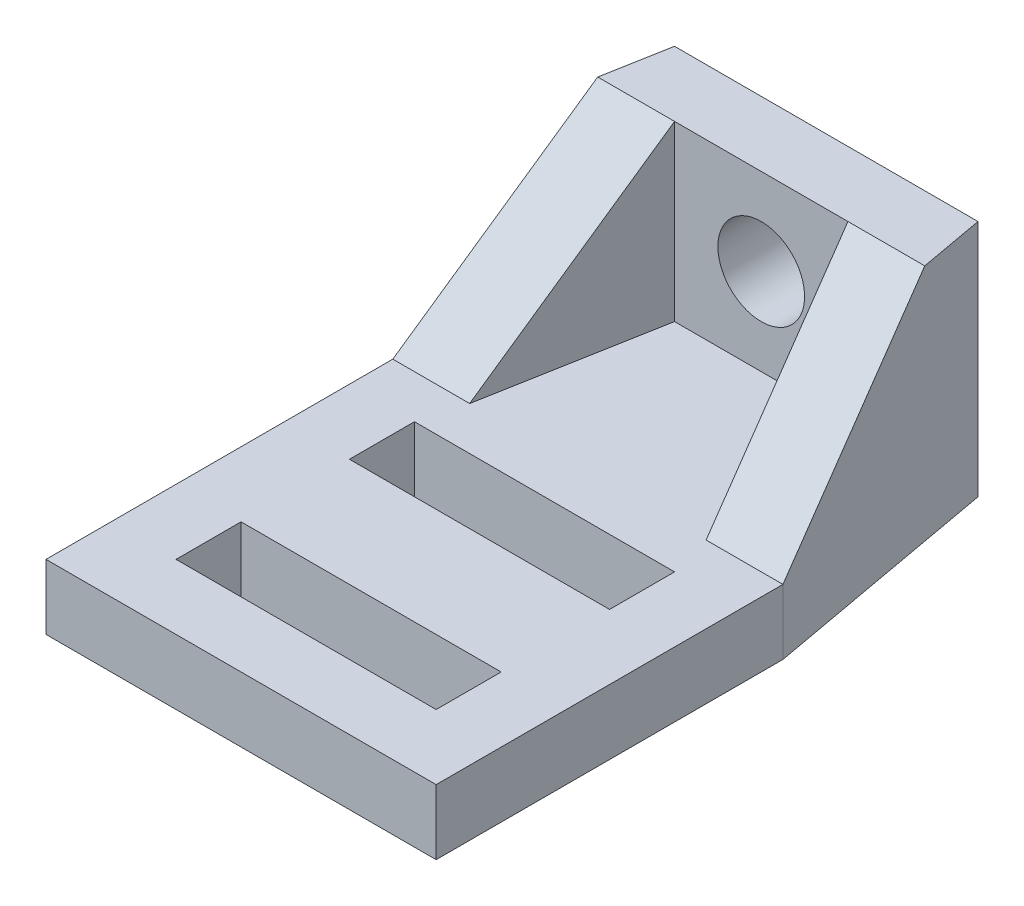
ISO-10303-21;
HEADER;
FILE_DESCRIPTION(('STEP AP214'),'2;1');
FILE_NAME('part.step','',(''),(''),'','','');
FILE_SCHEMA(('AUTOMOTIVE_DESIGN { 1 0 10303 214 1 1 1 1 }'));
ENDSEC;
DATA;
#1=APPLICATION_CONTEXT('core data for automotive mechanical design processes');
#2=APPLICATION_PROTOCOL_DEFINITION('international standard','automotive_design',2000,#1);
#3=PRODUCT_CONTEXT('',#1,'mechanical');
#4=PRODUCT('Part','Part','',(#3));
#5=PRODUCT_RELATED_PRODUCT_CATEGORY('part','',(#4));
#6=PRODUCT_DEFINITION_FORMATION('','',#4);
#7=PRODUCT_DEFINITION_CONTEXT('part definition',#1,'design');
#8=PRODUCT_DEFINITION('design','',#6,#7);
#9=PRODUCT_DEFINITION_SHAPE('','',#8);
#10=(LENGTH_UNIT() NAMED_UNIT(*) SI_UNIT(.MILLI.,.METRE.));
#11=(NAMED_UNIT(*) PLANE_ANGLE_UNIT() SI_UNIT($,.RADIAN.));
#12=(NAMED_UNIT(*) SI_UNIT($,.STERADIAN.) SOLID_ANGLE_UNIT());
#13=UNCERTAINTY_MEASURE_WITH_UNIT(LENGTH_MEASURE(1.E-05),#10,'distance_accuracy_value','');
#14=(GEOMETRIC_REPRESENTATION_CONTEXT(3) GLOBAL_UNCERTAINTY_ASSIGNED_CONTEXT((#13)) GLOBAL_UNIT_ASSIGNED_CONTEXT((#10,
#11,#12)) REPRESENTATION_CONTEXT('',''));
#15=CARTESIAN_POINT('',(0.,0.,0.));
#16=DIRECTION('',(0.,0.,1.));
#17=DIRECTION('',(1.,0.,0.));
#18=AXIS2_PLACEMENT_3D('',#15,#16,#17);
#19=CARTESIAN_POINT('',(7.,3.,-13.5));
#20=DIRECTION('',(-0.983869910099908,0.,0.178885438199983));
#21=DIRECTION('',(0.178885438199983,0.,0.983869910099908));
#22=AXIS2_PLACEMENT_3D('',#19,#20,#21);
#23=PLANE('',#22);
#24=DIRECTION('',(-0.127515342612668,0.701334384369668,-0.701334384369676));
#25=VECTOR('',#24,1.);
#26=CARTESIAN_POINT('',(7.98373983739836,8.58943089430894,-8.089430894309));
#27=LINE('',#26,#25);
#28=CARTESIAN_POINT('',(9.,3.,-2.5));
#29=VERTEX_POINT('',#28);
#30=CARTESIAN_POINT('',(7.54545454545453,11.,-10.5000000000001));
#31=VERTEX_POINT('',#30);
#32=EDGE_CURVE('E239',#29,#31,#27,.T.);
#33=ORIENTED_EDGE('',*,*,#32,.F.);
#34=DIRECTION('',(0.,-1.,0.));
#35=VECTOR('',#34,1.);
#36=CARTESIAN_POINT('',(9.,3.,-2.5));
#37=LINE('',#36,#35);
#38=CARTESIAN_POINT('',(9.,0.,-2.5));
#39=VERTEX_POINT('',#38);
#40=EDGE_CURVE('E305',#29,#39,#37,.T.);
#41=ORIENTED_EDGE('',*,*,#40,.T.);
#42=DIRECTION('',(-0.178885438199983,0.,-0.983869910099907));
#43=VECTOR('',#42,1.);
#44=CARTESIAN_POINT('',(7.,0.,-13.5));
#45=LINE('',#44,#43);
#46=CARTESIAN_POINT('',(7.,0.,-13.5));
#47=VERTEX_POINT('',#46);
#48=EDGE_CURVE('E283',#39,#47,#45,.T.);
#49=ORIENTED_EDGE('',*,*,#48,.T.);
#50=DIRECTION('',(0.,-1.,0.));
#51=VECTOR('',#50,1.);
#52=CARTESIAN_POINT('',(7.,3.,-13.5));
#53=LINE('',#52,#51);
#54=CARTESIAN_POINT('',(7.,11.,-13.5));
#55=VERTEX_POINT('',#54);
#56=EDGE_CURVE('E303',#55,#47,#53,.T.);
#57=ORIENTED_EDGE('',*,*,#56,.F.);
#58=DIRECTION('',(-0.178885438199983,0.,-0.983869910099907));
#59=VECTOR('',#58,1.);
#60=CARTESIAN_POINT('',(7.,11.,-13.5));
#61=LINE('',#60,#59);
#62=EDGE_CURVE('E245',#31,#55,#61,.T.);
#63=ORIENTED_EDGE('',*,*,#62,.F.);
#64=EDGE_LOOP('',(#33,#41,#49,#57,#63));
#65=FACE_BOUND('',#64,.T.);
#66=ADVANCED_FACE('F35',(#65),#23,.F.);
#67=CARTESIAN_POINT('',(-7.,3.,-13.5));
#68=DIRECTION('',(0.983869910099908,0.,0.178885438199983));
#69=DIRECTION('',(0.178885438199983,0.,-0.983869910099908));
#70=AXIS2_PLACEMENT_3D('',#67,#68,#69);
#71=PLANE('',#70);
#72=DIRECTION('',(-0.127515342612668,-0.701334384369668,0.701334384369676));
#73=VECTOR('',#72,1.);
#74=CARTESIAN_POINT('',(-7.98373983739836,8.58943089430894,-8.089430894309));
#75=LINE('',#74,#73);
#76=CARTESIAN_POINT('',(-7.54545454545453,11.,-10.5000000000001));
#77=VERTEX_POINT('',#76);
#78=CARTESIAN_POINT('',(-9.,3.,-2.5));
#79=VERTEX_POINT('',#78);
#80=EDGE_CURVE('E237',#77,#79,#75,.T.);
#81=ORIENTED_EDGE('',*,*,#80,.F.);
#82=DIRECTION('',(-0.178885438199983,0.,0.983869910099907));
#83=VECTOR('',#82,1.);
#84=CARTESIAN_POINT('',(-9.,11.,-2.5));
#85=LINE('',#84,#83);
#86=CARTESIAN_POINT('',(-7.,11.,-13.5));
#87=VERTEX_POINT('',#86);
#88=EDGE_CURVE('E251',#87,#77,#85,.T.);
#89=ORIENTED_EDGE('',*,*,#88,.F.);
#90=DIRECTION('',(0.,-1.,0.));
#91=VECTOR('',#90,1.);
#92=CARTESIAN_POINT('',(-7.,3.,-13.5));
#93=LINE('',#92,#91);
#94=CARTESIAN_POINT('',(-7.,0.,-13.5));
#95=VERTEX_POINT('',#94);
#96=EDGE_CURVE('E300',#87,#95,#93,.T.);
#97=ORIENTED_EDGE('',*,*,#96,.T.);
#98=DIRECTION('',(-0.178885438199983,0.,0.983869910099907));
#99=VECTOR('',#98,1.);
#100=CARTESIAN_POINT('',(-7.,0.,-13.5));
#101=LINE('',#100,#99);
#102=CARTESIAN_POINT('',(-9.,0.,-2.5));
#103=VERTEX_POINT('',#102);
#104=EDGE_CURVE('E287',#95,#103,#101,.T.);
#105=ORIENTED_EDGE('',*,*,#104,.T.);
#106=DIRECTION('',(0.,-1.,0.));
#107=VECTOR('',#106,1.);
#108=CARTESIAN_POINT('',(-9.,3.,-2.5));
#109=LINE('',#108,#107);
#110=EDGE_CURVE('E297',#79,#103,#109,.T.);
#111=ORIENTED_EDGE('',*,*,#110,.F.);
#112=EDGE_LOOP('',(#81,#89,#97,#105,#111));
#113=FACE_BOUND('',#112,.T.);
#114=ADVANCED_FACE('F321',(#113),#71,.F.);
#115=CARTESIAN_POINT('',(-4.,11.,-10.5));
#116=DIRECTION('',(-0.983869910099907,0.,-0.178885438199983));
#117=DIRECTION('',(-0.178885438199983,0.,0.983869910099907));
#118=AXIS2_PLACEMENT_3D('',#115,#116,#117);
#119=PLANE('',#118);
#120=DIRECTION('',(0.127515342612668,0.701334384369668,-0.701334384369676));
#121=VECTOR('',#120,1.);
#122=CARTESIAN_POINT('',(-3.99999999999999,11.,-10.5));
#123=LINE('',#122,#121);
#124=CARTESIAN_POINT('',(-5.45454545454545,3.,-2.5));
#125=VERTEX_POINT('',#124);
#126=CARTESIAN_POINT('',(-4.,11.,-10.5));
#127=VERTEX_POINT('',#126);
#128=EDGE_CURVE('E235',#125,#127,#123,.T.);
#129=ORIENTED_EDGE('',*,*,#128,.F.);
#130=DIRECTION('',(0.178885438199983,0.,-0.983869910099907));
#131=VECTOR('',#130,1.);
#132=CARTESIAN_POINT('',(-4.,3.,-10.5));
#133=LINE('',#132,#131);
#134=CARTESIAN_POINT('',(-4.,3.,-10.5));
#135=VERTEX_POINT('',#134);
#136=EDGE_CURVE('E256',#125,#135,#133,.T.);
#137=ORIENTED_EDGE('',*,*,#136,.T.);
#138=DIRECTION('',(0.,-1.,0.));
#139=VECTOR('',#138,1.);
#140=CARTESIAN_POINT('',(-4.,11.,-10.5));
#141=LINE('',#140,#139);
#142=EDGE_CURVE('E268',#127,#135,#141,.T.);
#143=ORIENTED_EDGE('',*,*,#142,.F.);
#144=EDGE_LOOP('',(#129,#137,#143));
#145=FACE_BOUND('',#144,.T.);
#146=ADVANCED_FACE('F349',(#145),#119,.F.);
#147=CARTESIAN_POINT('',(4.,11.,-10.5));
#148=DIRECTION('',(0.983869910099907,0.,-0.178885438199983));
#149=DIRECTION('',(-0.178885438199983,0.,-0.983869910099907));
#150=AXIS2_PLACEMENT_3D('',#147,#148,#149);
#151=PLANE('',#150);
#152=DIRECTION('',(0.127515342612668,-0.701334384369668,0.701334384369676));
#153=VECTOR('',#152,1.);
#154=CARTESIAN_POINT('',(3.99999999999999,11.,-10.5));
#155=LINE('',#154,#153);
#156=CARTESIAN_POINT('',(4.,11.,-10.5000000000001));
#157=VERTEX_POINT('',#156);
#158=CARTESIAN_POINT('',(5.45454545454546,3.,-2.5));
#159=VERTEX_POINT('',#158);
#160=EDGE_CURVE('E233',#157,#159,#155,.T.);
#161=ORIENTED_EDGE('',*,*,#160,.F.);
#162=DIRECTION('',(0.,-1.,0.));
#163=VECTOR('',#162,1.);
#164=CARTESIAN_POINT('',(4.,11.,-10.5));
#165=LINE('',#164,#163);
#166=CARTESIAN_POINT('',(4.,3.,-10.5));
#167=VERTEX_POINT('',#166);
#168=EDGE_CURVE('E254',#157,#167,#165,.T.);
#169=ORIENTED_EDGE('',*,*,#168,.T.);
#170=DIRECTION('',(0.178885438199983,0.,0.983869910099907));
#171=VECTOR('',#170,1.);
#172=CARTESIAN_POINT('',(4.,3.,-10.5));
#173=LINE('',#172,#171);
#174=EDGE_CURVE('E262',#167,#159,#173,.T.);
#175=ORIENTED_EDGE('',*,*,#174,.T.);
#176=EDGE_LOOP('',(#161,#169,#175));
#177=FACE_BOUND('',#176,.T.);
#178=ADVANCED_FACE('F364',(#177),#151,.F.);
#179=CARTESIAN_POINT('',(0.,11.,0.));
#180=DIRECTION('',(0.,-1.,0.));
#181=DIRECTION('',(0.,0.,-1.));
#182=AXIS2_PLACEMENT_3D('',#179,#180,#181);
#183=PLANE('',#182);
#184=DIRECTION('',(-1.,0.,0.));
#185=VECTOR('',#184,1.);
#186=CARTESIAN_POINT('',(0.,11.,-10.5000000000001));
#187=LINE('',#186,#185);
#188=EDGE_CURVE('E11',#31,#157,#187,.T.);
#189=ORIENTED_EDGE('',*,*,#188,.F.);
#190=ORIENTED_EDGE('',*,*,#62,.T.);
#191=DIRECTION('',(-1.,0.,0.));
#192=VECTOR('',#191,1.);
#193=CARTESIAN_POINT('',(-7.,11.,-13.5));
#194=LINE('',#193,#192);
#195=EDGE_CURVE('E248',#55,#87,#194,.T.);
#196=ORIENTED_EDGE('',*,*,#195,.T.);
#197=ORIENTED_EDGE('',*,*,#88,.T.);
#198=EDGE_CURVE('E39',#127,#77,#187,.T.);
#199=ORIENTED_EDGE('',*,*,#198,.F.);
#200=DIRECTION('',(1.,0.,0.));
#201=VECTOR('',#200,1.);
#202=CARTESIAN_POINT('',(-4.,11.,-10.5));
#203=LINE('',#202,#201);
#204=EDGE_CURVE('E242',#127,#157,#203,.T.);
#205=ORIENTED_EDGE('',*,*,#204,.T.);
#206=EDGE_LOOP('',(#189,#190,#196,#197,#199,#205));
#207=FACE_BOUND('',#206,.T.);
#208=ADVANCED_FACE('F324',(#207),#183,.F.);
#209=CARTESIAN_POINT('',(9.,3.,13.5));
#210=DIRECTION('',(-1.,0.,0.));
#211=DIRECTION('',(0.,0.,1.));
#212=AXIS2_PLACEMENT_3D('',#209,#210,#211);
#213=PLANE('',#212);
#214=DIRECTION('',(0.,0.,-1.));
#215=VECTOR('',#214,1.);
#216=CARTESIAN_POINT('',(9.,0.,13.5));
#217=LINE('',#216,#215);
#218=CARTESIAN_POINT('',(9.,0.,13.5));
#219=VERTEX_POINT('',#218);
#220=EDGE_CURVE('E271',#219,#39,#217,.T.);
#221=ORIENTED_EDGE('',*,*,#220,.T.);
#222=ORIENTED_EDGE('',*,*,#40,.F.);
#223=DIRECTION('',(0.,0.,-1.));
#224=VECTOR('',#223,1.);
#225=CARTESIAN_POINT('',(9.,3.,13.5));
#226=LINE('',#225,#224);
#227=CARTESIAN_POINT('',(9.,3.,13.5));
#228=VERTEX_POINT('',#227);
#229=EDGE_CURVE('E272',#228,#29,#226,.T.);
#230=ORIENTED_EDGE('',*,*,#229,.F.);
#231=DIRECTION('',(0.,-1.,0.));
#232=VECTOR('',#231,1.);
#233=CARTESIAN_POINT('',(9.,3.,13.5));
#234=LINE('',#233,#232);
#235=EDGE_CURVE('E280',#228,#219,#234,.T.);
#236=ORIENTED_EDGE('',*,*,#235,.T.);
#237=EDGE_LOOP('',(#221,#222,#230,#236));
#238=FACE_BOUND('',#237,.T.);
#239=ADVANCED_FACE('F37',(#238),#213,.F.);
#240=CARTESIAN_POINT('',(7.,3.,-13.5));
#241=DIRECTION('',(0.,0.,1.));
#242=DIRECTION('',(1.,0.,0.));
#243=AXIS2_PLACEMENT_3D('',#240,#241,#242);
#244=PLANE('',#243);
#245=CARTESIAN_POINT('',(0.,7.,-13.5));
#246=DIRECTION('',(0.,0.,-1.));
#247=DIRECTION('',(-1.,0.,0.));
#248=AXIS2_PLACEMENT_3D('',#245,#246,#247);
#249=CIRCLE('',#248,1.99999999999999);
#250=CARTESIAN_POINT('',(-1.99999999999999,7.,-13.5));
#251=VERTEX_POINT('',#250);
#252=EDGE_CURVE('E221',#251,#251,#249,.T.);
#253=ORIENTED_EDGE('',*,*,#252,.F.);
#254=EDGE_LOOP('',(#253));
#255=FACE_BOUND('',#254,.T.);
#256=DIRECTION('',(-1.,0.,0.));
#257=VECTOR('',#256,1.);
#258=CARTESIAN_POINT('',(7.,0.,-13.5));
#259=LINE('',#258,#257);
#260=EDGE_CURVE('E285',#47,#95,#259,.T.);
#261=ORIENTED_EDGE('',*,*,#260,.T.);
#262=ORIENTED_EDGE('',*,*,#96,.F.);
#263=ORIENTED_EDGE('',*,*,#195,.F.);
#264=ORIENTED_EDGE('',*,*,#56,.T.);
#265=EDGE_LOOP('',(#261,#262,#263,#264));
#266=FACE_BOUND('',#265,.T.);
#267=ADVANCED_FACE('F329',(#255,#266),#244,.F.);
#268=CARTESIAN_POINT('',(-9.,3.,13.5));
#269=DIRECTION('',(1.,0.,0.));
#270=DIRECTION('',(0.,0.,-1.));
#271=AXIS2_PLACEMENT_3D('',#268,#269,#270);
#272=PLANE('',#271);
#273=DIRECTION('',(0.,0.,1.));
#274=VECTOR('',#273,1.);
#275=CARTESIAN_POINT('',(-9.,0.,13.5));
#276=LINE('',#275,#274);
#277=CARTESIAN_POINT('',(-9.,0.,13.5));
#278=VERTEX_POINT('',#277);
#279=EDGE_CURVE('E289',#103,#278,#276,.T.);
#280=ORIENTED_EDGE('',*,*,#279,.T.);
#281=DIRECTION('',(0.,-1.,0.));
#282=VECTOR('',#281,1.);
#283=CARTESIAN_POINT('',(-9.,3.,13.5));
#284=LINE('',#283,#282);
#285=CARTESIAN_POINT('',(-9.,3.,13.5));
#286=VERTEX_POINT('',#285);
#287=EDGE_CURVE('E294',#286,#278,#284,.T.);
#288=ORIENTED_EDGE('',*,*,#287,.F.);
#289=DIRECTION('',(0.,0.,1.));
#290=VECTOR('',#289,1.);
#291=CARTESIAN_POINT('',(-9.,3.,13.5));
#292=LINE('',#291,#290);
#293=EDGE_CURVE('E275',#79,#286,#292,.T.);
#294=ORIENTED_EDGE('',*,*,#293,.F.);
#295=ORIENTED_EDGE('',*,*,#110,.T.);
#296=EDGE_LOOP('',(#280,#288,#294,#295));
#297=FACE_BOUND('',#296,.T.);
#298=ADVANCED_FACE('F338',(#297),#272,.F.);
#299=CARTESIAN_POINT('',(9.,3.,13.5));
#300=DIRECTION('',(0.,0.,-1.));
#301=DIRECTION('',(-1.,0.,0.));
#302=AXIS2_PLACEMENT_3D('',#299,#300,#301);
#303=PLANE('',#302);
#304=DIRECTION('',(1.,0.,0.));
#305=VECTOR('',#304,1.);
#306=CARTESIAN_POINT('',(9.,0.,13.5));
#307=LINE('',#306,#305);
#308=EDGE_CURVE('E276',#278,#219,#307,.T.);
#309=ORIENTED_EDGE('',*,*,#308,.T.);
#310=ORIENTED_EDGE('',*,*,#235,.F.);
#311=DIRECTION('',(1.,0.,0.));
#312=VECTOR('',#311,1.);
#313=CARTESIAN_POINT('',(9.,3.,13.5));
#314=LINE('',#313,#312);
#315=EDGE_CURVE('E278',#286,#228,#314,.T.);
#316=ORIENTED_EDGE('',*,*,#315,.F.);
#317=ORIENTED_EDGE('',*,*,#287,.T.);
#318=EDGE_LOOP('',(#309,#310,#316,#317));
#319=FACE_BOUND('',#318,.T.);
#320=ADVANCED_FACE('F341',(#319),#303,.F.);
#321=CARTESIAN_POINT('',(0.,3.,0.));
#322=DIRECTION('',(0.,1.,0.));
#323=DIRECTION('',(0.,0.,1.));
#324=AXIS2_PLACEMENT_3D('',#321,#322,#323);
#325=PLANE('',#324);
#326=DIRECTION('',(0.,0.,1.));
#327=VECTOR('',#326,1.);
#328=CARTESIAN_POINT('',(-6.,3.,-0.500000000000007));
#329=LINE('',#328,#327);
#330=CARTESIAN_POINT('',(-6.,3.,-0.500000000000007));
#331=VERTEX_POINT('',#330);
#332=CARTESIAN_POINT('',(-6.,3.,2.49999999999999));
#333=VERTEX_POINT('',#332);
#334=EDGE_CURVE('E50',#331,#333,#329,.T.);
#335=ORIENTED_EDGE('',*,*,#334,.F.);
#336=DIRECTION('',(-1.,0.,0.));
#337=VECTOR('',#336,1.);
#338=CARTESIAN_POINT('',(6.,3.,-0.500000000000008));
#339=LINE('',#338,#337);
#340=CARTESIAN_POINT('',(6.,3.,-0.500000000000008));
#341=VERTEX_POINT('',#340);
#342=EDGE_CURVE('E177',#341,#331,#339,.T.);
#343=ORIENTED_EDGE('',*,*,#342,.F.);
#344=DIRECTION('',(0.,0.,-1.));
#345=VECTOR('',#344,1.);
#346=CARTESIAN_POINT('',(6.,3.,-0.500000000000008));
#347=LINE('',#346,#345);
#348=CARTESIAN_POINT('',(6.,3.,2.49999999999999));
#349=VERTEX_POINT('',#348);
#350=EDGE_CURVE('E180',#349,#341,#347,.T.);
#351=ORIENTED_EDGE('',*,*,#350,.F.);
#352=DIRECTION('',(1.,0.,0.));
#353=VECTOR('',#352,1.);
#354=CARTESIAN_POINT('',(6.,3.,2.49999999999999));
#355=LINE('',#354,#353);
#356=EDGE_CURVE('E186',#333,#349,#355,.T.);
#357=ORIENTED_EDGE('',*,*,#356,.F.);
#358=EDGE_LOOP('',(#335,#343,#351,#357));
#359=FACE_BOUND('',#358,.T.);
#360=DIRECTION('',(0.,0.,1.));
#361=VECTOR('',#360,1.);
#362=CARTESIAN_POINT('',(-6.,3.,10.5));
#363=LINE('',#362,#361);
#364=CARTESIAN_POINT('',(-6.,3.,7.49999999999999));
#365=VERTEX_POINT('',#364);
#366=CARTESIAN_POINT('',(-6.,3.,10.5));
#367=VERTEX_POINT('',#366);
#368=EDGE_CURVE('E192',#365,#367,#363,.T.);
#369=ORIENTED_EDGE('',*,*,#368,.F.);
#370=DIRECTION('',(-1.,0.,0.));
#371=VECTOR('',#370,1.);
#372=CARTESIAN_POINT('',(6.,3.,7.49999999999999));
#373=LINE('',#372,#371);
#374=CARTESIAN_POINT('',(6.,3.,7.49999999999999));
#375=VERTEX_POINT('',#374);
#376=EDGE_CURVE('E200',#375,#365,#373,.T.);
#377=ORIENTED_EDGE('',*,*,#376,.F.);
#378=DIRECTION('',(0.,0.,-1.));
#379=VECTOR('',#378,1.);
#380=CARTESIAN_POINT('',(6.,3.,10.5));
#381=LINE('',#380,#379);
#382=CARTESIAN_POINT('',(6.,3.,10.5));
#383=VERTEX_POINT('',#382);
#384=EDGE_CURVE('E214',#383,#375,#381,.T.);
#385=ORIENTED_EDGE('',*,*,#384,.F.);
#386=DIRECTION('',(1.,0.,0.));
#387=VECTOR('',#386,1.);
#388=CARTESIAN_POINT('',(6.,3.,10.5));
#389=LINE('',#388,#387);
#390=EDGE_CURVE('E211',#367,#383,#389,.T.);
#391=ORIENTED_EDGE('',*,*,#390,.F.);
#392=EDGE_LOOP('',(#369,#377,#385,#391));
#393=FACE_BOUND('',#392,.T.);
#394=DIRECTION('',(1.,0.,0.));
#395=VECTOR('',#394,1.);
#396=CARTESIAN_POINT('',(5.45454545454546,3.,-2.5));
#397=LINE('',#396,#395);
#398=EDGE_CURVE('E246',#159,#29,#397,.T.);
#399=ORIENTED_EDGE('',*,*,#398,.F.);
#400=ORIENTED_EDGE('',*,*,#174,.F.);
#401=DIRECTION('',(1.,0.,0.));
#402=VECTOR('',#401,1.);
#403=CARTESIAN_POINT('',(-4.,3.,-10.5));
#404=LINE('',#403,#402);
#405=EDGE_CURVE('E259',#135,#167,#404,.T.);
#406=ORIENTED_EDGE('',*,*,#405,.F.);
#407=ORIENTED_EDGE('',*,*,#136,.F.);
#408=DIRECTION('',(1.,0.,0.));
#409=VECTOR('',#408,1.);
#410=CARTESIAN_POINT('',(-9.,3.,-2.5));
#411=LINE('',#410,#409);
#412=EDGE_CURVE('E241',#79,#125,#411,.T.);
#413=ORIENTED_EDGE('',*,*,#412,.F.);
#414=ORIENTED_EDGE('',*,*,#293,.T.);
#415=ORIENTED_EDGE('',*,*,#315,.T.);
#416=ORIENTED_EDGE('',*,*,#229,.T.);
#417=EDGE_LOOP('',(#399,#400,#406,#407,#413,#414,#415,#416));
#418=FACE_BOUND('',#417,.T.);
#419=ADVANCED_FACE('F346',(#359,#393,#418),#325,.T.);
#420=CARTESIAN_POINT('',(0.,0.,0.));
#421=DIRECTION('',(0.,1.,0.));
#422=DIRECTION('',(0.,0.,1.));
#423=AXIS2_PLACEMENT_3D('',#420,#421,#422);
#424=PLANE('',#423);
#425=DIRECTION('',(-1.,0.,0.));
#426=VECTOR('',#425,1.);
#427=CARTESIAN_POINT('',(6.,0.,-0.500000000000008));
#428=LINE('',#427,#426);
#429=CARTESIAN_POINT('',(6.,0.,-0.500000000000008));
#430=VERTEX_POINT('',#429);
#431=CARTESIAN_POINT('',(-6.,0.,-0.500000000000007));
#432=VERTEX_POINT('',#431);
#433=EDGE_CURVE('E167',#430,#432,#428,.T.);
#434=ORIENTED_EDGE('',*,*,#433,.T.);
#435=DIRECTION('',(0.,0.,1.));
#436=VECTOR('',#435,1.);
#437=CARTESIAN_POINT('',(-6.,0.,-0.500000000000007));
#438=LINE('',#437,#436);
#439=CARTESIAN_POINT('',(-6.,0.,2.49999999999999));
#440=VERTEX_POINT('',#439);
#441=EDGE_CURVE('E161',#432,#440,#438,.T.);
#442=ORIENTED_EDGE('',*,*,#441,.T.);
#443=DIRECTION('',(1.,0.,0.));
#444=VECTOR('',#443,1.);
#445=CARTESIAN_POINT('',(6.,0.,2.49999999999999));
#446=LINE('',#445,#444);
#447=CARTESIAN_POINT('',(6.,0.,2.49999999999999));
#448=VERTEX_POINT('',#447);
#449=EDGE_CURVE('E170',#440,#448,#446,.T.);
#450=ORIENTED_EDGE('',*,*,#449,.T.);
#451=DIRECTION('',(0.,0.,-1.));
#452=VECTOR('',#451,1.);
#453=CARTESIAN_POINT('',(6.,0.,-0.500000000000008));
#454=LINE('',#453,#452);
#455=EDGE_CURVE('E58',#448,#430,#454,.T.);
#456=ORIENTED_EDGE('',*,*,#455,.T.);
#457=EDGE_LOOP('',(#434,#442,#450,#456));
#458=FACE_BOUND('',#457,.T.);
#459=DIRECTION('',(-1.,0.,0.));
#460=VECTOR('',#459,1.);
#461=CARTESIAN_POINT('',(6.,0.,7.49999999999999));
#462=LINE('',#461,#460);
#463=CARTESIAN_POINT('',(6.,0.,7.49999999999999));
#464=VERTEX_POINT('',#463);
#465=CARTESIAN_POINT('',(-6.,0.,7.49999999999999));
#466=VERTEX_POINT('',#465);
#467=EDGE_CURVE('E206',#464,#466,#462,.T.);
#468=ORIENTED_EDGE('',*,*,#467,.T.);
#469=DIRECTION('',(0.,0.,1.));
#470=VECTOR('',#469,1.);
#471=CARTESIAN_POINT('',(-6.,0.,10.5));
#472=LINE('',#471,#470);
#473=CARTESIAN_POINT('',(-6.,0.,10.5));
#474=VERTEX_POINT('',#473);
#475=EDGE_CURVE('E196',#466,#474,#472,.T.);
#476=ORIENTED_EDGE('',*,*,#475,.T.);
#477=DIRECTION('',(1.,0.,0.));
#478=VECTOR('',#477,1.);
#479=CARTESIAN_POINT('',(6.,0.,10.5));
#480=LINE('',#479,#478);
#481=CARTESIAN_POINT('',(6.,0.,10.5));
#482=VERTEX_POINT('',#481);
#483=EDGE_CURVE('E199',#474,#482,#480,.T.);
#484=ORIENTED_EDGE('',*,*,#483,.T.);
#485=DIRECTION('',(0.,0.,-1.));
#486=VECTOR('',#485,1.);
#487=CARTESIAN_POINT('',(6.,0.,10.5));
#488=LINE('',#487,#486);
#489=EDGE_CURVE('E203',#482,#464,#488,.T.);
#490=ORIENTED_EDGE('',*,*,#489,.T.);
#491=EDGE_LOOP('',(#468,#476,#484,#490));
#492=FACE_BOUND('',#491,.T.);
#493=ORIENTED_EDGE('',*,*,#220,.F.);
#494=ORIENTED_EDGE('',*,*,#308,.F.);
#495=ORIENTED_EDGE('',*,*,#279,.F.);
#496=ORIENTED_EDGE('',*,*,#104,.F.);
#497=ORIENTED_EDGE('',*,*,#260,.F.);
#498=ORIENTED_EDGE('',*,*,#48,.F.);
#499=EDGE_LOOP('',(#493,#494,#495,#496,#497,#498));
#500=FACE_BOUND('',#499,.T.);
#501=ADVANCED_FACE('F174',(#458,#492,#500),#424,.F.);
#502=CARTESIAN_POINT('',(-4.,11.,-10.5));
#503=DIRECTION('',(0.,0.,-1.));
#504=DIRECTION('',(-1.,0.,0.));
#505=AXIS2_PLACEMENT_3D('',#502,#503,#504);
#506=PLANE('',#505);
#507=CARTESIAN_POINT('',(0.,7.,-10.5));
#508=DIRECTION('',(0.,0.,-1.));
#509=DIRECTION('',(-1.,0.,0.));
#510=AXIS2_PLACEMENT_3D('',#507,#508,#509);
#511=CIRCLE('',#510,1.99999999999999);
#512=CARTESIAN_POINT('',(-1.99999999999999,7.,-10.5));
#513=VERTEX_POINT('',#512);
#514=EDGE_CURVE('E230',#513,#513,#511,.T.);
#515=ORIENTED_EDGE('',*,*,#514,.T.);
#516=EDGE_LOOP('',(#515));
#517=FACE_BOUND('',#516,.T.);
#518=ORIENTED_EDGE('',*,*,#405,.T.);
#519=ORIENTED_EDGE('',*,*,#168,.F.);
#520=ORIENTED_EDGE('',*,*,#204,.F.);
#521=ORIENTED_EDGE('',*,*,#142,.T.);
#522=EDGE_LOOP('',(#518,#519,#520,#521));
#523=FACE_BOUND('',#522,.T.);
#524=ADVANCED_FACE('F353',(#517,#523),#506,.F.);
#525=CARTESIAN_POINT('',(9.,3.,-2.5));
#526=DIRECTION('',(0.,0.707106781186551,0.707106781186543));
#527=DIRECTION('',(0.,-0.707106781186544,0.707106781186551));
#528=AXIS2_PLACEMENT_3D('',#525,#526,#527);
#529=PLANE('',#528);
#530=ORIENTED_EDGE('',*,*,#80,.T.);
#531=ORIENTED_EDGE('',*,*,#412,.T.);
#532=ORIENTED_EDGE('',*,*,#128,.T.);
#533=ORIENTED_EDGE('',*,*,#198,.T.);
#534=EDGE_LOOP('',(#530,#531,#532,#533));
#535=FACE_BOUND('',#534,.T.);
#536=ADVANCED_FACE('F313',(#535),#529,.T.);
#537=ORIENTED_EDGE('',*,*,#32,.T.);
#538=ORIENTED_EDGE('',*,*,#188,.T.);
#539=ORIENTED_EDGE('',*,*,#160,.T.);
#540=ORIENTED_EDGE('',*,*,#398,.T.);
#541=EDGE_LOOP('',(#537,#538,#539,#540));
#542=FACE_BOUND('',#541,.T.);
#543=ADVANCED_FACE('F389',(#542),#529,.T.);
#544=CARTESIAN_POINT('',(0.,7.,-13.5));
#545=DIRECTION('',(0.,0.,-1.));
#546=DIRECTION('',(-1.,0.,0.));
#547=AXIS2_PLACEMENT_3D('',#544,#545,#546);
#548=CYLINDRICAL_SURFACE('',#547,1.99999999999999);
#549=ORIENTED_EDGE('',*,*,#252,.T.);
#550=EDGE_LOOP('',(#549));
#551=FACE_BOUND('',#550,.T.);
#552=ORIENTED_EDGE('',*,*,#514,.F.);
#553=EDGE_LOOP('',(#552));
#554=FACE_BOUND('',#553,.T.);
#555=ADVANCED_FACE('F392',(#551,#554),#548,.F.);
#556=CARTESIAN_POINT('',(-6.,0.,10.5));
#557=DIRECTION('',(-1.,0.,0.));
#558=DIRECTION('',(0.,0.,1.));
#559=AXIS2_PLACEMENT_3D('',#556,#557,#558);
#560=PLANE('',#559);
#561=ORIENTED_EDGE('',*,*,#368,.T.);
#562=DIRECTION('',(0.,1.,0.));
#563=VECTOR('',#562,1.);
#564=CARTESIAN_POINT('',(-6.,0.,10.5));
#565=LINE('',#564,#563);
#566=EDGE_CURVE('E209',#474,#367,#565,.T.);
#567=ORIENTED_EDGE('',*,*,#566,.F.);
#568=ORIENTED_EDGE('',*,*,#475,.F.);
#569=DIRECTION('',(0.,1.,0.));
#570=VECTOR('',#569,1.);
#571=CARTESIAN_POINT('',(-6.,0.,7.49999999999999));
#572=LINE('',#571,#570);
#573=EDGE_CURVE('E219',#466,#365,#572,.T.);
#574=ORIENTED_EDGE('',*,*,#573,.T.);
#575=EDGE_LOOP('',(#561,#567,#568,#574));
#576=FACE_BOUND('',#575,.T.);
#577=ADVANCED_FACE('F395',(#576),#560,.F.);
#578=CARTESIAN_POINT('',(6.,0.,7.49999999999999));
#579=DIRECTION('',(0.,0.,-1.));
#580=DIRECTION('',(-1.,0.,0.));
#581=AXIS2_PLACEMENT_3D('',#578,#579,#580);
#582=PLANE('',#581);
#583=ORIENTED_EDGE('',*,*,#376,.T.);
#584=ORIENTED_EDGE('',*,*,#573,.F.);
#585=ORIENTED_EDGE('',*,*,#467,.F.);
#586=DIRECTION('',(0.,1.,0.));
#587=VECTOR('',#586,1.);
#588=CARTESIAN_POINT('',(6.,0.,7.49999999999999));
#589=LINE('',#588,#587);
#590=EDGE_CURVE('E222',#464,#375,#589,.T.);
#591=ORIENTED_EDGE('',*,*,#590,.T.);
#592=EDGE_LOOP('',(#583,#584,#585,#591));
#593=FACE_BOUND('',#592,.T.);
#594=ADVANCED_FACE('F399',(#593),#582,.F.);
#595=CARTESIAN_POINT('',(6.,0.,10.5));
#596=DIRECTION('',(1.,0.,0.));
#597=DIRECTION('',(0.,0.,-1.));
#598=AXIS2_PLACEMENT_3D('',#595,#596,#597);
#599=PLANE('',#598);
#600=ORIENTED_EDGE('',*,*,#384,.T.);
#601=ORIENTED_EDGE('',*,*,#590,.F.);
#602=ORIENTED_EDGE('',*,*,#489,.F.);
#603=DIRECTION('',(0.,1.,0.));
#604=VECTOR('',#603,1.);
#605=CARTESIAN_POINT('',(6.,0.,10.5));
#606=LINE('',#605,#604);
#607=EDGE_CURVE('E224',#482,#383,#606,.T.);
#608=ORIENTED_EDGE('',*,*,#607,.T.);
#609=EDGE_LOOP('',(#600,#601,#602,#608));
#610=FACE_BOUND('',#609,.T.);
#611=ADVANCED_FACE('F404',(#610),#599,.F.);
#612=CARTESIAN_POINT('',(6.,0.,10.5));
#613=DIRECTION('',(0.,0.,1.));
#614=DIRECTION('',(1.,0.,0.));
#615=AXIS2_PLACEMENT_3D('',#612,#613,#614);
#616=PLANE('',#615);
#617=ORIENTED_EDGE('',*,*,#390,.T.);
#618=ORIENTED_EDGE('',*,*,#607,.F.);
#619=ORIENTED_EDGE('',*,*,#483,.F.);
#620=ORIENTED_EDGE('',*,*,#566,.T.);
#621=EDGE_LOOP('',(#617,#618,#619,#620));
#622=FACE_BOUND('',#621,.T.);
#623=ADVANCED_FACE('F401',(#622),#616,.F.);
#624=CARTESIAN_POINT('',(-6.,0.,-0.500000000000007));
#625=DIRECTION('',(-1.,0.,0.));
#626=DIRECTION('',(0.,0.,1.));
#627=AXIS2_PLACEMENT_3D('',#624,#625,#626);
#628=PLANE('',#627);
#629=ORIENTED_EDGE('',*,*,#334,.T.);
#630=DIRECTION('',(0.,1.,0.));
#631=VECTOR('',#630,1.);
#632=CARTESIAN_POINT('',(-6.,0.,2.49999999999999));
#633=LINE('',#632,#631);
#634=EDGE_CURVE('E157',#440,#333,#633,.T.);
#635=ORIENTED_EDGE('',*,*,#634,.F.);
#636=ORIENTED_EDGE('',*,*,#441,.F.);
#637=DIRECTION('',(0.,1.,0.));
#638=VECTOR('',#637,1.);
#639=CARTESIAN_POINT('',(-6.,0.,-0.500000000000007));
#640=LINE('',#639,#638);
#641=EDGE_CURVE('E190',#432,#331,#640,.T.);
#642=ORIENTED_EDGE('',*,*,#641,.T.);
#643=EDGE_LOOP('',(#629,#635,#636,#642));
#644=FACE_BOUND('',#643,.T.);
#645=ADVANCED_FACE('F159',(#644),#628,.F.);
#646=CARTESIAN_POINT('',(6.,0.,-0.500000000000008));
#647=DIRECTION('',(0.,0.,-1.));
#648=DIRECTION('',(-1.,0.,0.));
#649=AXIS2_PLACEMENT_3D('',#646,#647,#648);
#650=PLANE('',#649);
#651=ORIENTED_EDGE('',*,*,#342,.T.);
#652=ORIENTED_EDGE('',*,*,#641,.F.);
#653=ORIENTED_EDGE('',*,*,#433,.F.);
#654=DIRECTION('',(0.,1.,0.));
#655=VECTOR('',#654,1.);
#656=CARTESIAN_POINT('',(6.,0.,-0.500000000000008));
#657=LINE('',#656,#655);
#658=EDGE_CURVE('E193',#430,#341,#657,.T.);
#659=ORIENTED_EDGE('',*,*,#658,.T.);
#660=EDGE_LOOP('',(#651,#652,#653,#659));
#661=FACE_BOUND('',#660,.T.);
#662=ADVANCED_FACE('F414',(#661),#650,.F.);
#663=CARTESIAN_POINT('',(6.,0.,-0.500000000000008));
#664=DIRECTION('',(1.,0.,0.));
#665=DIRECTION('',(0.,0.,-1.));
#666=AXIS2_PLACEMENT_3D('',#663,#664,#665);
#667=PLANE('',#666);
#668=ORIENTED_EDGE('',*,*,#350,.T.);
#669=ORIENTED_EDGE('',*,*,#658,.F.);
#670=ORIENTED_EDGE('',*,*,#455,.F.);
#671=DIRECTION('',(0.,1.,0.));
#672=VECTOR('',#671,1.);
#673=CARTESIAN_POINT('',(6.,0.,2.49999999999999));
#674=LINE('',#673,#672);
#675=EDGE_CURVE('E166',#448,#349,#674,.T.);
#676=ORIENTED_EDGE('',*,*,#675,.T.);
#677=EDGE_LOOP('',(#668,#669,#670,#676));
#678=FACE_BOUND('',#677,.T.);
#679=ADVANCED_FACE('F417',(#678),#667,.F.);
#680=CARTESIAN_POINT('',(6.,0.,2.49999999999999));
#681=DIRECTION('',(0.,0.,1.));
#682=DIRECTION('',(1.,0.,0.));
#683=AXIS2_PLACEMENT_3D('',#680,#681,#682);
#684=PLANE('',#683);
#685=ORIENTED_EDGE('',*,*,#356,.T.);
#686=ORIENTED_EDGE('',*,*,#675,.F.);
#687=ORIENTED_EDGE('',*,*,#449,.F.);
#688=ORIENTED_EDGE('',*,*,#634,.T.);
#689=EDGE_LOOP('',(#685,#686,#687,#688));
#690=FACE_BOUND('',#689,.T.);
#691=ADVANCED_FACE('F171',(#690),#684,.F.);
#692=CLOSED_SHELL('',(#66,#114,#146,#178,#208,#239,#267,#298,#320,#419,#501,#524,#536,#543,#555,
#577,#594,#611,#623,#645,#662,#679,#691));
#693=MANIFOLD_SOLID_BREP('B2',#692);
#694=ADVANCED_BREP_SHAPE_REPRESENTATION('',(#18,#693),#14);
#695=SHAPE_DEFINITION_REPRESENTATION(#9,#694);
ENDSEC;
END-ISO-10303-21;
